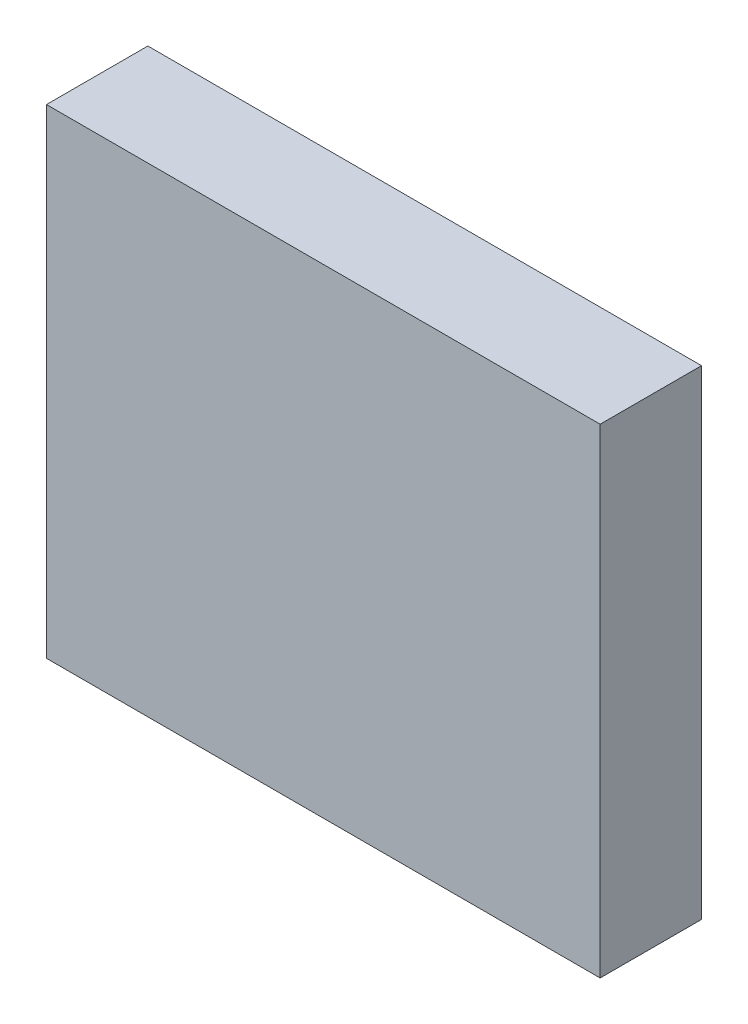
ISO-10303-21;
HEADER;
FILE_DESCRIPTION(('STEP AP214'),'2;1');
FILE_NAME('part.step','',(''),(''),'','','');
FILE_SCHEMA(('AUTOMOTIVE_DESIGN { 1 0 10303 214 1 1 1 1 }'));
ENDSEC;
DATA;
#1=APPLICATION_CONTEXT('core data for automotive mechanical design processes');
#2=APPLICATION_PROTOCOL_DEFINITION('international standard','automotive_design',2000,#1);
#3=PRODUCT_CONTEXT('',#1,'mechanical');
#4=PRODUCT('Part','Part','',(#3));
#5=PRODUCT_RELATED_PRODUCT_CATEGORY('part','',(#4));
#6=PRODUCT_DEFINITION_FORMATION('','',#4);
#7=PRODUCT_DEFINITION_CONTEXT('part definition',#1,'design');
#8=PRODUCT_DEFINITION('design','',#6,#7);
#9=PRODUCT_DEFINITION_SHAPE('','',#8);
#10=(LENGTH_UNIT() NAMED_UNIT(*) SI_UNIT(.MILLI.,.METRE.));
#11=(NAMED_UNIT(*) PLANE_ANGLE_UNIT() SI_UNIT($,.RADIAN.));
#12=(NAMED_UNIT(*) SI_UNIT($,.STERADIAN.) SOLID_ANGLE_UNIT());
#13=UNCERTAINTY_MEASURE_WITH_UNIT(LENGTH_MEASURE(1.E-05),#10,'distance_accuracy_value','');
#14=(GEOMETRIC_REPRESENTATION_CONTEXT(3) GLOBAL_UNCERTAINTY_ASSIGNED_CONTEXT((#13)) GLOBAL_UNIT_ASSIGNED_CONTEXT((#10,
#11,#12)) REPRESENTATION_CONTEXT('',''));
#15=CARTESIAN_POINT('',(0.,0.,0.));
#16=DIRECTION('',(0.,0.,1.));
#17=DIRECTION('',(1.,0.,0.));
#18=AXIS2_PLACEMENT_3D('',#15,#16,#17);
#19=CARTESIAN_POINT('',(3.14000134,2.71999964,1.15000024));
#20=DIRECTION('',(0.,0.,1.));
#21=DIRECTION('',(1.,0.,0.));
#22=AXIS2_PLACEMENT_3D('',#19,#20,#21);
#23=PLANE('',#22);
#24=DIRECTION('',(1.,0.,0.));
#25=VECTOR('',#24,1.);
#26=CARTESIAN_POINT('',(3.14000134,-2.71999964,1.15000024));
#27=LINE('',#26,#25);
#28=CARTESIAN_POINT('',(3.14000134,-2.71999964,1.15000024));
#29=VERTEX_POINT('',#28);
#30=CARTESIAN_POINT('',(-3.1399988,-2.71999964,1.15000024));
#31=VERTEX_POINT('',#30);
#32=EDGE_CURVE('E52',#29,#31,#27,.F.);
#33=ORIENTED_EDGE('',*,*,#32,.F.);
#34=DIRECTION('',(0.,1.,0.));
#35=VECTOR('',#34,1.);
#36=CARTESIAN_POINT('',(3.14000134,2.71999964,1.15000024));
#37=LINE('',#36,#35);
#38=CARTESIAN_POINT('',(3.14000134,2.71999964,1.15000024));
#39=VERTEX_POINT('',#38);
#40=EDGE_CURVE('E67',#39,#29,#37,.F.);
#41=ORIENTED_EDGE('',*,*,#40,.F.);
#42=DIRECTION('',(1.,0.,0.));
#43=VECTOR('',#42,1.);
#44=CARTESIAN_POINT('',(-3.1399988,2.71999964,1.15000024));
#45=LINE('',#44,#43);
#46=CARTESIAN_POINT('',(-3.1399988,2.71999964,1.15000024));
#47=VERTEX_POINT('',#46);
#48=EDGE_CURVE('E19',#47,#39,#45,.T.);
#49=ORIENTED_EDGE('',*,*,#48,.F.);
#50=DIRECTION('',(0.,1.,0.));
#51=VECTOR('',#50,1.);
#52=CARTESIAN_POINT('',(-3.1399988,-2.71999964,1.15000024));
#53=LINE('',#52,#51);
#54=EDGE_CURVE('E57',#31,#47,#53,.T.);
#55=ORIENTED_EDGE('',*,*,#54,.F.);
#56=EDGE_LOOP('',(#33,#41,#49,#55));
#57=FACE_BOUND('',#56,.T.);
#58=ADVANCED_FACE('F16',(#57),#23,.T.);
#59=CARTESIAN_POINT('',(-3.1399988,2.71999964,0.));
#60=DIRECTION('',(0.,1.,0.));
#61=DIRECTION('',(0.,0.,1.));
#62=AXIS2_PLACEMENT_3D('',#59,#60,#61);
#63=PLANE('',#62);
#64=DIRECTION('',(0.,0.,-1.));
#65=VECTOR('',#64,1.);
#66=CARTESIAN_POINT('',(3.14000134,2.71999964,0.));
#67=LINE('',#66,#65);
#68=CARTESIAN_POINT('',(3.14000134,2.71999964,0.));
#69=VERTEX_POINT('',#68);
#70=EDGE_CURVE('E78',#69,#39,#67,.F.);
#71=ORIENTED_EDGE('',*,*,#70,.F.);
#72=DIRECTION('',(1.,0.,0.));
#73=VECTOR('',#72,1.);
#74=CARTESIAN_POINT('',(3.14000134,2.71999964,0.));
#75=LINE('',#74,#73);
#76=CARTESIAN_POINT('',(-3.1399988,2.71999964,0.));
#77=VERTEX_POINT('',#76);
#78=EDGE_CURVE('E73',#69,#77,#75,.F.);
#79=ORIENTED_EDGE('',*,*,#78,.T.);
#80=DIRECTION('',(0.,0.,1.));
#81=VECTOR('',#80,1.);
#82=CARTESIAN_POINT('',(-3.1399988,2.71999964,0.));
#83=LINE('',#82,#81);
#84=EDGE_CURVE('E62',#47,#77,#83,.F.);
#85=ORIENTED_EDGE('',*,*,#84,.F.);
#86=ORIENTED_EDGE('',*,*,#48,.T.);
#87=EDGE_LOOP('',(#71,#79,#85,#86));
#88=FACE_BOUND('',#87,.T.);
#89=ADVANCED_FACE('F72',(#88),#63,.T.);
#90=CARTESIAN_POINT('',(-3.1399988,-2.71999964,0.));
#91=DIRECTION('',(-1.,0.,0.));
#92=DIRECTION('',(0.,0.,1.));
#93=AXIS2_PLACEMENT_3D('',#90,#91,#92);
#94=PLANE('',#93);
#95=ORIENTED_EDGE('',*,*,#84,.T.);
#96=DIRECTION('',(0.,1.,0.));
#97=VECTOR('',#96,1.);
#98=CARTESIAN_POINT('',(-3.1399988,2.71999964,0.));
#99=LINE('',#98,#97);
#100=CARTESIAN_POINT('',(-3.1399988,-2.71999964,0.));
#101=VERTEX_POINT('',#100);
#102=EDGE_CURVE('E83',#77,#101,#99,.F.);
#103=ORIENTED_EDGE('',*,*,#102,.T.);
#104=DIRECTION('',(0.,0.,-1.));
#105=VECTOR('',#104,1.);
#106=CARTESIAN_POINT('',(-3.1399988,-2.71999964,0.));
#107=LINE('',#106,#105);
#108=EDGE_CURVE('E64',#31,#101,#107,.T.);
#109=ORIENTED_EDGE('',*,*,#108,.F.);
#110=ORIENTED_EDGE('',*,*,#54,.T.);
#111=EDGE_LOOP('',(#95,#103,#109,#110));
#112=FACE_BOUND('',#111,.T.);
#113=ADVANCED_FACE('F59',(#112),#94,.T.);
#114=CARTESIAN_POINT('',(3.14000134,-2.71999964,0.));
#115=DIRECTION('',(0.,-1.,0.));
#116=DIRECTION('',(0.,0.,-1.));
#117=AXIS2_PLACEMENT_3D('',#114,#115,#116);
#118=PLANE('',#117);
#119=ORIENTED_EDGE('',*,*,#108,.T.);
#120=DIRECTION('',(1.,0.,0.));
#121=VECTOR('',#120,1.);
#122=CARTESIAN_POINT('',(3.14000134,-2.71999964,0.));
#123=LINE('',#122,#121);
#124=CARTESIAN_POINT('',(3.14000134,-2.71999964,0.));
#125=VERTEX_POINT('',#124);
#126=EDGE_CURVE('E25',#101,#125,#123,.T.);
#127=ORIENTED_EDGE('',*,*,#126,.T.);
#128=DIRECTION('',(0.,0.,-1.));
#129=VECTOR('',#128,1.);
#130=CARTESIAN_POINT('',(3.14000134,-2.71999964,0.));
#131=LINE('',#130,#129);
#132=EDGE_CURVE('E33',#29,#125,#131,.T.);
#133=ORIENTED_EDGE('',*,*,#132,.F.);
#134=ORIENTED_EDGE('',*,*,#32,.T.);
#135=EDGE_LOOP('',(#119,#127,#133,#134));
#136=FACE_BOUND('',#135,.T.);
#137=ADVANCED_FACE('F87',(#136),#118,.T.);
#138=CARTESIAN_POINT('',(3.14000134,2.71999964,0.));
#139=DIRECTION('',(1.,0.,0.));
#140=DIRECTION('',(0.,0.,-1.));
#141=AXIS2_PLACEMENT_3D('',#138,#139,#140);
#142=PLANE('',#141);
#143=ORIENTED_EDGE('',*,*,#132,.T.);
#144=DIRECTION('',(0.,1.,0.));
#145=VECTOR('',#144,1.);
#146=CARTESIAN_POINT('',(3.14000134,2.71999964,0.));
#147=LINE('',#146,#145);
#148=EDGE_CURVE('E11',#125,#69,#147,.T.);
#149=ORIENTED_EDGE('',*,*,#148,.T.);
#150=ORIENTED_EDGE('',*,*,#70,.T.);
#151=ORIENTED_EDGE('',*,*,#40,.T.);
#152=EDGE_LOOP('',(#143,#149,#150,#151));
#153=FACE_BOUND('',#152,.T.);
#154=ADVANCED_FACE('F90',(#153),#142,.T.);
#155=CARTESIAN_POINT('',(3.14000134,2.71999964,0.));
#156=DIRECTION('',(0.,0.,1.));
#157=DIRECTION('',(1.,0.,0.));
#158=AXIS2_PLACEMENT_3D('',#155,#156,#157);
#159=PLANE('',#158);
#160=ORIENTED_EDGE('',*,*,#126,.F.);
#161=ORIENTED_EDGE('',*,*,#102,.F.);
#162=ORIENTED_EDGE('',*,*,#78,.F.);
#163=ORIENTED_EDGE('',*,*,#148,.F.);
#164=EDGE_LOOP('',(#160,#161,#162,#163));
#165=FACE_BOUND('',#164,.T.);
#166=ADVANCED_FACE('F89',(#165),#159,.F.);
#167=CLOSED_SHELL('',(#58,#89,#113,#137,#154,#166));
#168=MANIFOLD_SOLID_BREP('B1',#167);
#169=ADVANCED_BREP_SHAPE_REPRESENTATION('',(#18,#168),#14);
#170=SHAPE_DEFINITION_REPRESENTATION(#9,#169);
ENDSEC;
END-ISO-10303-21;
